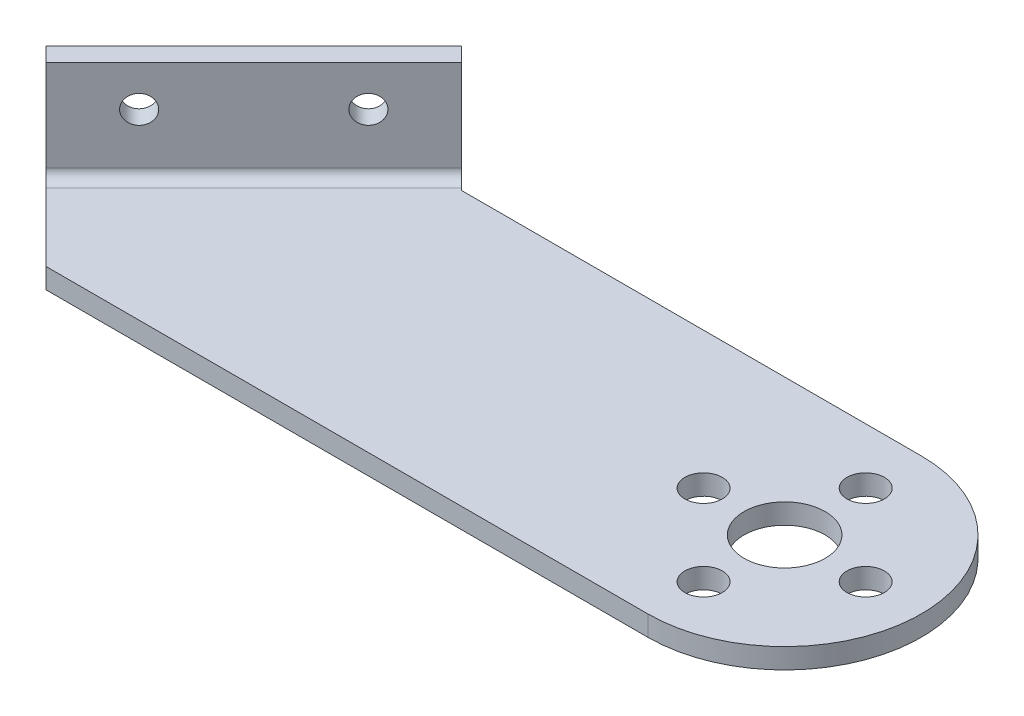
ISO-10303-21;
HEADER;
FILE_DESCRIPTION(('STEP AP214'),'2;1');
FILE_NAME('part.step','',(''),(''),'','','');
FILE_SCHEMA(('AUTOMOTIVE_DESIGN { 1 0 10303 214 1 1 1 1 }'));
ENDSEC;
DATA;
#1=APPLICATION_CONTEXT('core data for automotive mechanical design processes');
#2=APPLICATION_PROTOCOL_DEFINITION('international standard','automotive_design',2000,#1);
#3=PRODUCT_CONTEXT('',#1,'mechanical');
#4=PRODUCT('Part','Part','',(#3));
#5=PRODUCT_RELATED_PRODUCT_CATEGORY('part','',(#4));
#6=PRODUCT_DEFINITION_FORMATION('','',#4);
#7=PRODUCT_DEFINITION_CONTEXT('part definition',#1,'design');
#8=PRODUCT_DEFINITION('design','',#6,#7);
#9=PRODUCT_DEFINITION_SHAPE('','',#8);
#10=(LENGTH_UNIT() NAMED_UNIT(*) SI_UNIT(.MILLI.,.METRE.));
#11=(NAMED_UNIT(*) PLANE_ANGLE_UNIT() SI_UNIT($,.RADIAN.));
#12=(NAMED_UNIT(*) SI_UNIT($,.STERADIAN.) SOLID_ANGLE_UNIT());
#13=UNCERTAINTY_MEASURE_WITH_UNIT(LENGTH_MEASURE(1.E-05),#10,'distance_accuracy_value','');
#14=(GEOMETRIC_REPRESENTATION_CONTEXT(3) GLOBAL_UNCERTAINTY_ASSIGNED_CONTEXT((#13)) GLOBAL_UNIT_ASSIGNED_CONTEXT((#10,
#11,#12)) REPRESENTATION_CONTEXT('',''));
#15=CARTESIAN_POINT('',(0.,0.,0.));
#16=DIRECTION('',(0.,0.,1.));
#17=DIRECTION('',(1.,0.,0.));
#18=AXIS2_PLACEMENT_3D('',#15,#16,#17);
#19=CARTESIAN_POINT('',(13.7940246351911,8.,-9.12741699796952));
#20=DIRECTION('',(-0.707106781186548,0.,-0.707106781186547));
#21=DIRECTION('',(-0.707106781186548,0.,0.707106781186548));
#22=AXIS2_PLACEMENT_3D('',#19,#20,#21);
#23=CYLINDRICAL_SURFACE('',#22,1.36525);
#24=CARTESIAN_POINT('',(11.6727042916315,8.,-11.2487373415292));
#25=DIRECTION('',(-0.707106781186548,0.,-0.707106781186547));
#26=DIRECTION('',(-0.707106781186548,0.,0.707106781186548));
#27=AXIS2_PLACEMENT_3D('',#24,#25,#26);
#28=CIRCLE('',#27,1.36525);
#29=CARTESIAN_POINT('',(10.7073267586166,8.,-10.2833598085142));
#30=VERTEX_POINT('',#29);
#31=EDGE_CURVE('E164',#30,#30,#28,.T.);
#32=ORIENTED_EDGE('',*,*,#31,.T.);
#33=EDGE_LOOP('',(#32));
#34=FACE_BOUND('',#33,.T.);
#35=CARTESIAN_POINT('',(13.0869178540046,8.,-9.83452377915606));
#36=DIRECTION('',(-0.707106781186548,0.,-0.707106781186548));
#37=DIRECTION('',(-0.707106781186548,0.,0.707106781186548));
#38=AXIS2_PLACEMENT_3D('',#35,#36,#37);
#39=CIRCLE('',#38,1.36525);
#40=CARTESIAN_POINT('',(12.1215403209897,8.,-8.86914624614113));
#41=VERTEX_POINT('',#40);
#42=EDGE_CURVE('E206',#41,#41,#39,.T.);
#43=ORIENTED_EDGE('',*,*,#42,.F.);
#44=EDGE_LOOP('',(#43));
#45=FACE_BOUND('',#44,.T.);
#46=ADVANCED_FACE('F49',(#34,#45),#23,.F.);
#47=CARTESIAN_POINT('',(2.48031613620638,8.00000000000001,2.18629150101524));
#48=DIRECTION('',(-0.707106781186548,0.,-0.707106781186547));
#49=DIRECTION('',(-0.707106781186548,0.,0.707106781186548));
#50=AXIS2_PLACEMENT_3D('',#47,#48,#49);
#51=CYLINDRICAL_SURFACE('',#50,1.36525);
#52=CARTESIAN_POINT('',(0.358995792646737,8.00000000000001,0.0649711574556011));
#53=DIRECTION('',(-0.707106781186548,0.,-0.707106781186547));
#54=DIRECTION('',(-0.707106781186548,0.,0.707106781186548));
#55=AXIS2_PLACEMENT_3D('',#52,#53,#54);
#56=CIRCLE('',#55,1.36525);
#57=CARTESIAN_POINT('',(-0.606381740368197,8.00000000000001,1.03034869047054));
#58=VERTEX_POINT('',#57);
#59=EDGE_CURVE('E225',#58,#58,#56,.T.);
#60=ORIENTED_EDGE('',*,*,#59,.T.);
#61=EDGE_LOOP('',(#60));
#62=FACE_BOUND('',#61,.T.);
#63=CARTESIAN_POINT('',(1.77320935501983,8.00000000000001,1.4791847198287));
#64=DIRECTION('',(-0.707106781186548,0.,-0.707106781186548));
#65=DIRECTION('',(-0.707106781186548,0.,0.707106781186548));
#66=AXIS2_PLACEMENT_3D('',#63,#64,#65);
#67=CIRCLE('',#66,1.36525);
#68=CARTESIAN_POINT('',(0.8078318220049,8.00000000000001,2.44456225284363));
#69=VERTEX_POINT('',#68);
#70=EDGE_CURVE('E211',#69,#69,#67,.T.);
#71=ORIENTED_EDGE('',*,*,#70,.F.);
#72=EDGE_LOOP('',(#71));
#73=FACE_BOUND('',#72,.T.);
#74=ADVANCED_FACE('F244',(#62,#73),#51,.F.);
#75=CARTESIAN_POINT('',(70.0090137395217,12.,37.8951839509359));
#76=DIRECTION('',(0.,1.,0.));
#77=DIRECTION('',(-0.707106781186548,0.,0.707106781186548));
#78=AXIS2_PLACEMENT_3D('',#75,#76,#77);
#79=PLANE('',#78);
#80=DIRECTION('',(-0.707106781186548,0.,-0.707106781186548));
#81=VECTOR('',#80,1.);
#82=CARTESIAN_POINT('',(70.0090137395217,12.,37.8951839509359));
#83=LINE('',#82,#81);
#84=CARTESIAN_POINT('',(17.6831119317172,12.,-14.4307178568686));
#85=VERTEX_POINT('',#84);
#86=CARTESIAN_POINT('',(16.2688983693441,12.,-15.8449314192417));
#87=VERTEX_POINT('',#86);
#88=EDGE_CURVE('E223',#85,#87,#83,.T.);
#89=ORIENTED_EDGE('',*,*,#88,.T.);
#90=DIRECTION('',(-0.707106781186547,0.,0.707106781186547));
#91=VECTOR('',#90,1.);
#92=CARTESIAN_POINT('',(16.2688983693441,12.,-15.8449314192417));
#93=LINE('',#92,#91);
#94=CARTESIAN_POINT('',(-4.23719828506582,12.,4.66116523516816));
#95=VERTEX_POINT('',#94);
#96=EDGE_CURVE('E145',#87,#95,#93,.T.);
#97=ORIENTED_EDGE('',*,*,#96,.T.);
#98=DIRECTION('',(-0.707106781186548,0.,-0.707106781186548));
#99=VECTOR('',#98,1.);
#100=CARTESIAN_POINT('',(49.5029170851118,12.,58.4012806053458));
#101=LINE('',#100,#99);
#102=CARTESIAN_POINT('',(-2.82298472269272,12.,6.07537879754126));
#103=VERTEX_POINT('',#102);
#104=EDGE_CURVE('E214',#103,#95,#101,.T.);
#105=ORIENTED_EDGE('',*,*,#104,.F.);
#106=DIRECTION('',(0.707106781186547,0.,-0.707106781186547));
#107=VECTOR('',#106,1.);
#108=CARTESIAN_POINT('',(17.6831119317172,12.,-14.4307178568686));
#109=LINE('',#108,#107);
#110=EDGE_CURVE('E68',#103,#85,#109,.T.);
#111=ORIENTED_EDGE('',*,*,#110,.T.);
#112=EDGE_LOOP('',(#89,#97,#105,#111));
#113=FACE_BOUND('',#112,.T.);
#114=ADVANCED_FACE('F241',(#113),#79,.T.);
#115=CARTESIAN_POINT('',(70.0090137395217,12.,37.8951839509359));
#116=DIRECTION('',(0.707106781186548,0.,-0.707106781186548));
#117=DIRECTION('',(0.,1.,0.));
#118=AXIS2_PLACEMENT_3D('',#115,#116,#117);
#119=PLANE('',#118);
#120=DIRECTION('',(-0.707106781186548,0.,-0.707106781186548));
#121=VECTOR('',#120,1.);
#122=CARTESIAN_POINT('',(70.0090137395217,3.,37.8951839509359));
#123=LINE('',#122,#121);
#124=CARTESIAN_POINT('',(17.6831119317172,3.,-14.4307178568686));
#125=VERTEX_POINT('',#124);
#126=CARTESIAN_POINT('',(16.2688983693441,3.,-15.8449314192417));
#127=VERTEX_POINT('',#126);
#128=EDGE_CURVE('E147',#125,#127,#123,.T.);
#129=ORIENTED_EDGE('',*,*,#128,.T.);
#130=DIRECTION('',(0.,1.,0.));
#131=VECTOR('',#130,1.);
#132=CARTESIAN_POINT('',(16.2688983693441,0.,-15.8449314192417));
#133=LINE('',#132,#131);
#134=EDGE_CURVE('E93',#127,#87,#133,.T.);
#135=ORIENTED_EDGE('',*,*,#134,.T.);
#136=ORIENTED_EDGE('',*,*,#88,.F.);
#137=DIRECTION('',(0.,-1.,0.));
#138=VECTOR('',#137,1.);
#139=CARTESIAN_POINT('',(17.6831119317172,12.,-14.4307178568686));
#140=LINE('',#139,#138);
#141=EDGE_CURVE('E146',#85,#125,#140,.T.);
#142=ORIENTED_EDGE('',*,*,#141,.T.);
#143=EDGE_LOOP('',(#129,#135,#136,#142));
#144=FACE_BOUND('',#143,.T.);
#145=ADVANCED_FACE('F151',(#144),#119,.T.);
#146=CARTESIAN_POINT('',(16.2688983693441,0.,-15.8449314192417));
#147=DIRECTION('',(-0.707106781186547,0.,-0.707106781186548));
#148=DIRECTION('',(-0.707106781186548,0.,0.707106781186548));
#149=AXIS2_PLACEMENT_3D('',#146,#147,#148);
#150=PLANE('',#149);
#151=DIRECTION('',(0.707106781186548,0.,-0.707106781186547));
#152=VECTOR('',#151,1.);
#153=CARTESIAN_POINT('',(16.2688983693441,3.00000000000001,-15.8449314192417));
#154=LINE('',#153,#152);
#155=CARTESIAN_POINT('',(-4.23719828506582,3.,4.66116523516816));
#156=VERTEX_POINT('',#155);
#157=EDGE_CURVE('E87',#156,#127,#154,.T.);
#158=ORIENTED_EDGE('',*,*,#157,.F.);
#159=DIRECTION('',(0.,1.,0.));
#160=VECTOR('',#159,1.);
#161=CARTESIAN_POINT('',(-4.23719828506582,12.,4.66116523516816));
#162=LINE('',#161,#160);
#163=EDGE_CURVE('E216',#156,#95,#162,.T.);
#164=ORIENTED_EDGE('',*,*,#163,.T.);
#165=ORIENTED_EDGE('',*,*,#96,.F.);
#166=ORIENTED_EDGE('',*,*,#134,.F.);
#167=EDGE_LOOP('',(#158,#164,#165,#166));
#168=FACE_BOUND('',#167,.T.);
#169=ORIENTED_EDGE('',*,*,#59,.F.);
#170=EDGE_LOOP('',(#169));
#171=FACE_BOUND('',#170,.T.);
#172=ORIENTED_EDGE('',*,*,#31,.F.);
#173=EDGE_LOOP('',(#172));
#174=FACE_BOUND('',#173,.T.);
#175=ADVANCED_FACE('F142',(#168,#171,#174),#150,.T.);
#176=CARTESIAN_POINT('',(49.5029170851118,12.,58.4012806053458));
#177=DIRECTION('',(0.707106781186548,0.,-0.707106781186548));
#178=DIRECTION('',(0.,1.,0.));
#179=AXIS2_PLACEMENT_3D('',#176,#177,#178);
#180=PLANE('',#179);
#181=ORIENTED_EDGE('',*,*,#163,.F.);
#182=DIRECTION('',(-0.707106781186548,0.,-0.707106781186548));
#183=VECTOR('',#182,1.);
#184=CARTESIAN_POINT('',(49.5029170851118,3.,58.4012806053458));
#185=LINE('',#184,#183);
#186=CARTESIAN_POINT('',(-2.82298472269272,2.99999999999999,6.07537879754126));
#187=VERTEX_POINT('',#186);
#188=EDGE_CURVE('E53',#187,#156,#185,.T.);
#189=ORIENTED_EDGE('',*,*,#188,.F.);
#190=DIRECTION('',(0.,-1.,0.));
#191=VECTOR('',#190,1.);
#192=CARTESIAN_POINT('',(-2.82298472269272,12.,6.07537879754126));
#193=LINE('',#192,#191);
#194=EDGE_CURVE('E59',#103,#187,#193,.T.);
#195=ORIENTED_EDGE('',*,*,#194,.F.);
#196=ORIENTED_EDGE('',*,*,#104,.T.);
#197=EDGE_LOOP('',(#181,#189,#195,#196));
#198=FACE_BOUND('',#197,.T.);
#199=ADVANCED_FACE('F234',(#198),#180,.F.);
#200=CARTESIAN_POINT('',(17.6831119317172,12.,-14.4307178568686));
#201=DIRECTION('',(-0.707106781186548,0.,-0.707106781186548));
#202=DIRECTION('',(-0.707106781186548,0.,0.707106781186548));
#203=AXIS2_PLACEMENT_3D('',#200,#201,#202);
#204=PLANE('',#203);
#205=ORIENTED_EDGE('',*,*,#70,.T.);
#206=EDGE_LOOP('',(#205));
#207=FACE_BOUND('',#206,.T.);
#208=ORIENTED_EDGE('',*,*,#42,.T.);
#209=EDGE_LOOP('',(#208));
#210=FACE_BOUND('',#209,.T.);
#211=ORIENTED_EDGE('',*,*,#194,.T.);
#212=DIRECTION('',(0.707106781186548,0.,-0.707106781186548));
#213=VECTOR('',#212,1.);
#214=CARTESIAN_POINT('',(17.6831119317172,3.,-14.4307178568686));
#215=LINE('',#214,#213);
#216=EDGE_CURVE('E13',#187,#125,#215,.T.);
#217=ORIENTED_EDGE('',*,*,#216,.T.);
#218=ORIENTED_EDGE('',*,*,#141,.F.);
#219=ORIENTED_EDGE('',*,*,#110,.F.);
#220=EDGE_LOOP('',(#211,#217,#218,#219));
#221=FACE_BOUND('',#220,.T.);
#222=ADVANCED_FACE('F51',(#207,#210,#221),#204,.F.);
#223=CARTESIAN_POINT('',(64.,0.,0.));
#224=DIRECTION('',(0.,1.,0.));
#225=DIRECTION('',(0.,0.,1.));
#226=AXIS2_PLACEMENT_3D('',#223,#224,#225);
#227=PLANE('',#226);
#228=CARTESIAN_POINT('',(56.,0.,0.));
#229=DIRECTION('',(0.,1.,0.));
#230=DIRECTION('',(0.,0.,-1.));
#231=AXIS2_PLACEMENT_3D('',#228,#229,#230);
#232=CIRCLE('',#231,1.85);
#233=CARTESIAN_POINT('',(56.,0.,-1.85));
#234=VERTEX_POINT('',#233);
#235=EDGE_CURVE('E289',#234,#234,#232,.T.);
#236=ORIENTED_EDGE('',*,*,#235,.T.);
#237=EDGE_LOOP('',(#236));
#238=FACE_BOUND('',#237,.T.);
#239=CARTESIAN_POINT('',(64.,0.,8.));
#240=DIRECTION('',(0.,1.,0.));
#241=DIRECTION('',(0.,0.,-1.));
#242=AXIS2_PLACEMENT_3D('',#239,#240,#241);
#243=CIRCLE('',#242,1.85);
#244=CARTESIAN_POINT('',(64.,0.,6.15));
#245=VERTEX_POINT('',#244);
#246=EDGE_CURVE('E370',#245,#245,#243,.T.);
#247=ORIENTED_EDGE('',*,*,#246,.T.);
#248=EDGE_LOOP('',(#247));
#249=FACE_BOUND('',#248,.T.);
#250=CARTESIAN_POINT('',(72.,0.,0.));
#251=DIRECTION('',(0.,1.,0.));
#252=DIRECTION('',(0.,0.,-1.));
#253=AXIS2_PLACEMENT_3D('',#250,#251,#252);
#254=CIRCLE('',#253,1.85);
#255=CARTESIAN_POINT('',(72.,0.,-1.85));
#256=VERTEX_POINT('',#255);
#257=EDGE_CURVE('E367',#256,#256,#254,.T.);
#258=ORIENTED_EDGE('',*,*,#257,.T.);
#259=EDGE_LOOP('',(#258));
#260=FACE_BOUND('',#259,.T.);
#261=CARTESIAN_POINT('',(64.,0.,-8.));
#262=DIRECTION('',(0.,1.,0.));
#263=DIRECTION('',(0.,0.,-1.));
#264=AXIS2_PLACEMENT_3D('',#261,#262,#263);
#265=CIRCLE('',#264,1.85);
#266=CARTESIAN_POINT('',(64.,0.,-9.85));
#267=VERTEX_POINT('',#266);
#268=EDGE_CURVE('E358',#267,#267,#265,.T.);
#269=ORIENTED_EDGE('',*,*,#268,.T.);
#270=EDGE_LOOP('',(#269));
#271=FACE_BOUND('',#270,.T.);
#272=CARTESIAN_POINT('',(64.,0.,0.));
#273=DIRECTION('',(0.,1.,0.));
#274=DIRECTION('',(0.,0.,-1.));
#275=AXIS2_PLACEMENT_3D('',#272,#273,#274);
#276=CIRCLE('',#275,4.);
#277=CARTESIAN_POINT('',(64.,0.,-4.));
#278=VERTEX_POINT('',#277);
#279=EDGE_CURVE('E354',#278,#278,#276,.T.);
#280=ORIENTED_EDGE('',*,*,#279,.T.);
#281=EDGE_LOOP('',(#280));
#282=FACE_BOUND('',#281,.T.);
#283=DIRECTION('',(-0.707106781186547,0.,0.707106781186548));
#284=VECTOR('',#283,1.);
#285=CARTESIAN_POINT('',(18.3902187129037,0.,-13.7236110756821));
#286=LINE('',#285,#284);
#287=CARTESIAN_POINT('',(18.3902187129037,0.,-13.7236110756821));
#288=VERTEX_POINT('',#287);
#289=CARTESIAN_POINT('',(-2.11587794150617,0.,6.78248557872781));
#290=VERTEX_POINT('',#289);
#291=EDGE_CURVE('E189',#288,#290,#286,.T.);
#292=ORIENTED_EDGE('',*,*,#291,.F.);
#293=DIRECTION('',(-0.707106781186547,0.,-0.707106781186548));
#294=VECTOR('',#293,1.);
#295=CARTESIAN_POINT('',(18.6138297885858,0.,-13.5));
#296=LINE('',#295,#294);
#297=CARTESIAN_POINT('',(18.6138297885858,0.,-13.5));
#298=VERTEX_POINT('',#297);
#299=EDGE_CURVE('E281',#298,#288,#296,.T.);
#300=ORIENTED_EDGE('',*,*,#299,.F.);
#301=DIRECTION('',(-1.,0.,0.));
#302=VECTOR('',#301,1.);
#303=CARTESIAN_POINT('',(64.,0.,-13.5));
#304=LINE('',#303,#302);
#305=CARTESIAN_POINT('',(64.,0.,-13.5));
#306=VERTEX_POINT('',#305);
#307=EDGE_CURVE('E284',#306,#298,#304,.T.);
#308=ORIENTED_EDGE('',*,*,#307,.F.);
#309=CARTESIAN_POINT('',(64.,0.,0.));
#310=DIRECTION('',(0.,1.,0.));
#311=DIRECTION('',(0.,0.,1.));
#312=AXIS2_PLACEMENT_3D('',#309,#310,#311);
#313=CIRCLE('',#312,13.5);
#314=CARTESIAN_POINT('',(64.,0.,13.5));
#315=VERTEX_POINT('',#314);
#316=EDGE_CURVE('E287',#315,#306,#313,.T.);
#317=ORIENTED_EDGE('',*,*,#316,.F.);
#318=DIRECTION('',(1.,0.,0.));
#319=VECTOR('',#318,1.);
#320=CARTESIAN_POINT('',(4.60163647976604,0.,13.5));
#321=LINE('',#320,#319);
#322=CARTESIAN_POINT('',(4.60163647976604,0.,13.5));
#323=VERTEX_POINT('',#322);
#324=EDGE_CURVE('E184',#323,#315,#321,.T.);
#325=ORIENTED_EDGE('',*,*,#324,.F.);
#326=DIRECTION('',(0.707106781186548,0.,0.707106781186547));
#327=VECTOR('',#326,1.);
#328=CARTESIAN_POINT('',(-4.23719828506582,0.,4.66116523516815));
#329=LINE('',#328,#327);
#330=EDGE_CURVE('E285',#290,#323,#329,.T.);
#331=ORIENTED_EDGE('',*,*,#330,.F.);
#332=EDGE_LOOP('',(#292,#300,#308,#317,#325,#331));
#333=FACE_BOUND('',#332,.T.);
#334=ADVANCED_FACE('F330',(#238,#249,#260,#271,#282,#333),#227,.F.);
#335=CARTESIAN_POINT('',(64.,2.,0.));
#336=DIRECTION('',(0.,1.,0.));
#337=DIRECTION('',(0.,0.,1.));
#338=AXIS2_PLACEMENT_3D('',#335,#336,#337);
#339=PLANE('',#338);
#340=CARTESIAN_POINT('',(64.,2.,0.));
#341=DIRECTION('',(0.,1.,0.));
#342=DIRECTION('',(0.,0.,-1.));
#343=AXIS2_PLACEMENT_3D('',#340,#341,#342);
#344=CIRCLE('',#343,4.);
#345=CARTESIAN_POINT('',(64.,2.,-4.));
#346=VERTEX_POINT('',#345);
#347=EDGE_CURVE('E384',#346,#346,#344,.T.);
#348=ORIENTED_EDGE('',*,*,#347,.F.);
#349=EDGE_LOOP('',(#348));
#350=FACE_BOUND('',#349,.T.);
#351=CARTESIAN_POINT('',(64.,2.,-8.));
#352=DIRECTION('',(0.,1.,0.));
#353=DIRECTION('',(0.,0.,-1.));
#354=AXIS2_PLACEMENT_3D('',#351,#352,#353);
#355=CIRCLE('',#354,1.85);
#356=CARTESIAN_POINT('',(64.,2.,-9.85));
#357=VERTEX_POINT('',#356);
#358=EDGE_CURVE('E382',#357,#357,#355,.T.);
#359=ORIENTED_EDGE('',*,*,#358,.F.);
#360=EDGE_LOOP('',(#359));
#361=FACE_BOUND('',#360,.T.);
#362=CARTESIAN_POINT('',(72.,2.,0.));
#363=DIRECTION('',(0.,1.,0.));
#364=DIRECTION('',(0.,0.,-1.));
#365=AXIS2_PLACEMENT_3D('',#362,#363,#364);
#366=CIRCLE('',#365,1.85);
#367=CARTESIAN_POINT('',(72.,2.,-1.85));
#368=VERTEX_POINT('',#367);
#369=EDGE_CURVE('E361',#368,#368,#366,.T.);
#370=ORIENTED_EDGE('',*,*,#369,.F.);
#371=EDGE_LOOP('',(#370));
#372=FACE_BOUND('',#371,.T.);
#373=CARTESIAN_POINT('',(64.,2.,8.));
#374=DIRECTION('',(0.,1.,0.));
#375=DIRECTION('',(0.,0.,-1.));
#376=AXIS2_PLACEMENT_3D('',#373,#374,#375);
#377=CIRCLE('',#376,1.85);
#378=CARTESIAN_POINT('',(64.,2.,6.15));
#379=VERTEX_POINT('',#378);
#380=EDGE_CURVE('E355',#379,#379,#377,.T.);
#381=ORIENTED_EDGE('',*,*,#380,.F.);
#382=EDGE_LOOP('',(#381));
#383=FACE_BOUND('',#382,.T.);
#384=CARTESIAN_POINT('',(56.,2.,0.));
#385=DIRECTION('',(0.,1.,0.));
#386=DIRECTION('',(0.,0.,-1.));
#387=AXIS2_PLACEMENT_3D('',#384,#385,#386);
#388=CIRCLE('',#387,1.85);
#389=CARTESIAN_POINT('',(56.,2.,-1.85));
#390=VERTEX_POINT('',#389);
#391=EDGE_CURVE('E352',#390,#390,#388,.T.);
#392=ORIENTED_EDGE('',*,*,#391,.F.);
#393=EDGE_LOOP('',(#392));
#394=FACE_BOUND('',#393,.T.);
#395=DIRECTION('',(-0.707106781186547,0.,-0.707106781186548));
#396=VECTOR('',#395,1.);
#397=CARTESIAN_POINT('',(18.6138297885858,2.,-13.5));
#398=LINE('',#397,#396);
#399=CARTESIAN_POINT('',(18.6138297885858,2.,-13.5));
#400=VERTEX_POINT('',#399);
#401=CARTESIAN_POINT('',(18.3902187129037,2.,-13.7236110756821));
#402=VERTEX_POINT('',#401);
#403=EDGE_CURVE('E278',#400,#402,#398,.T.);
#404=ORIENTED_EDGE('',*,*,#403,.T.);
#405=DIRECTION('',(-0.707106781186547,0.,0.707106781186548));
#406=VECTOR('',#405,1.);
#407=CARTESIAN_POINT('',(18.3902187129037,2.,-13.7236110756821));
#408=LINE('',#407,#406);
#409=CARTESIAN_POINT('',(-2.11587794150617,2.,6.7824855787278));
#410=VERTEX_POINT('',#409);
#411=EDGE_CURVE('E186',#402,#410,#408,.T.);
#412=ORIENTED_EDGE('',*,*,#411,.T.);
#413=DIRECTION('',(0.707106781186548,0.,0.707106781186547));
#414=VECTOR('',#413,1.);
#415=CARTESIAN_POINT('',(-4.23719828506582,2.,4.66116523516815));
#416=LINE('',#415,#414);
#417=CARTESIAN_POINT('',(4.60163647976604,2.00000000000006,13.5));
#418=VERTEX_POINT('',#417);
#419=EDGE_CURVE('E170',#410,#418,#416,.T.);
#420=ORIENTED_EDGE('',*,*,#419,.T.);
#421=DIRECTION('',(1.,0.,0.));
#422=VECTOR('',#421,1.);
#423=CARTESIAN_POINT('',(4.60163647976604,2.,13.5));
#424=LINE('',#423,#422);
#425=CARTESIAN_POINT('',(64.,2.00000000000006,13.5));
#426=VERTEX_POINT('',#425);
#427=EDGE_CURVE('E101',#418,#426,#424,.T.);
#428=ORIENTED_EDGE('',*,*,#427,.T.);
#429=CARTESIAN_POINT('',(64.,2.,0.));
#430=DIRECTION('',(0.,1.,0.));
#431=DIRECTION('',(0.,0.,1.));
#432=AXIS2_PLACEMENT_3D('',#429,#430,#431);
#433=CIRCLE('',#432,13.5);
#434=CARTESIAN_POINT('',(64.,2.00000000000006,-13.5));
#435=VERTEX_POINT('',#434);
#436=EDGE_CURVE('E109',#426,#435,#433,.T.);
#437=ORIENTED_EDGE('',*,*,#436,.T.);
#438=DIRECTION('',(-1.,0.,0.));
#439=VECTOR('',#438,1.);
#440=CARTESIAN_POINT('',(64.,2.,-13.5));
#441=LINE('',#440,#439);
#442=EDGE_CURVE('E393',#435,#400,#441,.T.);
#443=ORIENTED_EDGE('',*,*,#442,.T.);
#444=EDGE_LOOP('',(#404,#412,#420,#428,#437,#443));
#445=FACE_BOUND('',#444,.T.);
#446=ADVANCED_FACE('F275',(#350,#361,#372,#383,#394,#445),#339,.T.);
#447=CARTESIAN_POINT('',(56.,0.,0.));
#448=DIRECTION('',(0.,1.,0.));
#449=DIRECTION('',(0.,0.,1.));
#450=AXIS2_PLACEMENT_3D('',#447,#448,#449);
#451=CYLINDRICAL_SURFACE('',#450,1.85);
#452=ORIENTED_EDGE('',*,*,#235,.F.);
#453=EDGE_LOOP('',(#452));
#454=FACE_BOUND('',#453,.T.);
#455=ORIENTED_EDGE('',*,*,#391,.T.);
#456=EDGE_LOOP('',(#455));
#457=FACE_BOUND('',#456,.T.);
#458=ADVANCED_FACE('F339',(#454,#457),#451,.F.);
#459=CARTESIAN_POINT('',(64.,0.,8.));
#460=DIRECTION('',(0.,1.,0.));
#461=DIRECTION('',(0.,0.,1.));
#462=AXIS2_PLACEMENT_3D('',#459,#460,#461);
#463=CYLINDRICAL_SURFACE('',#462,1.85);
#464=ORIENTED_EDGE('',*,*,#246,.F.);
#465=EDGE_LOOP('',(#464));
#466=FACE_BOUND('',#465,.T.);
#467=ORIENTED_EDGE('',*,*,#380,.T.);
#468=EDGE_LOOP('',(#467));
#469=FACE_BOUND('',#468,.T.);
#470=ADVANCED_FACE('F336',(#466,#469),#463,.F.);
#471=CARTESIAN_POINT('',(72.,0.,0.));
#472=DIRECTION('',(0.,1.,0.));
#473=DIRECTION('',(0.,0.,1.));
#474=AXIS2_PLACEMENT_3D('',#471,#472,#473);
#475=CYLINDRICAL_SURFACE('',#474,1.85);
#476=ORIENTED_EDGE('',*,*,#257,.F.);
#477=EDGE_LOOP('',(#476));
#478=FACE_BOUND('',#477,.T.);
#479=ORIENTED_EDGE('',*,*,#369,.T.);
#480=EDGE_LOOP('',(#479));
#481=FACE_BOUND('',#480,.T.);
#482=ADVANCED_FACE('F322',(#478,#481),#475,.F.);
#483=CARTESIAN_POINT('',(64.,0.,-8.));
#484=DIRECTION('',(0.,1.,0.));
#485=DIRECTION('',(0.,0.,1.));
#486=AXIS2_PLACEMENT_3D('',#483,#484,#485);
#487=CYLINDRICAL_SURFACE('',#486,1.85);
#488=ORIENTED_EDGE('',*,*,#268,.F.);
#489=EDGE_LOOP('',(#488));
#490=FACE_BOUND('',#489,.T.);
#491=ORIENTED_EDGE('',*,*,#358,.T.);
#492=EDGE_LOOP('',(#491));
#493=FACE_BOUND('',#492,.T.);
#494=ADVANCED_FACE('F316',(#490,#493),#487,.F.);
#495=CARTESIAN_POINT('',(64.,0.,0.));
#496=DIRECTION('',(0.,1.,0.));
#497=DIRECTION('',(0.,0.,1.));
#498=AXIS2_PLACEMENT_3D('',#495,#496,#497);
#499=CYLINDRICAL_SURFACE('',#498,4.);
#500=ORIENTED_EDGE('',*,*,#279,.F.);
#501=EDGE_LOOP('',(#500));
#502=FACE_BOUND('',#501,.T.);
#503=ORIENTED_EDGE('',*,*,#347,.T.);
#504=EDGE_LOOP('',(#503));
#505=FACE_BOUND('',#504,.T.);
#506=ADVANCED_FACE('F312',(#502,#505),#499,.F.);
#507=CARTESIAN_POINT('',(18.6138297885858,168.283249557367,-13.5));
#508=DIRECTION('',(-0.707106781186548,0.,0.707106781186547));
#509=DIRECTION('',(0.707106781186547,0.,0.707106781186548));
#510=AXIS2_PLACEMENT_3D('',#507,#508,#509);
#511=PLANE('',#510);
#512=DIRECTION('',(0.,-1.,0.));
#513=VECTOR('',#512,1.);
#514=CARTESIAN_POINT('',(18.6138297885858,168.283249557367,-13.5));
#515=LINE('',#514,#513);
#516=EDGE_CURVE('E191',#400,#298,#515,.T.);
#517=ORIENTED_EDGE('',*,*,#516,.T.);
#518=ORIENTED_EDGE('',*,*,#299,.T.);
#519=DIRECTION('',(0.,-1.,0.));
#520=VECTOR('',#519,1.);
#521=CARTESIAN_POINT('',(18.3902187129037,168.283249557367,-13.7236110756821));
#522=LINE('',#521,#520);
#523=EDGE_CURVE('E167',#402,#288,#522,.T.);
#524=ORIENTED_EDGE('',*,*,#523,.F.);
#525=ORIENTED_EDGE('',*,*,#403,.F.);
#526=EDGE_LOOP('',(#517,#518,#524,#525));
#527=FACE_BOUND('',#526,.T.);
#528=ADVANCED_FACE('F252',(#527),#511,.F.);
#529=CARTESIAN_POINT('',(-4.23719828506582,168.283249557367,4.66116523516815));
#530=DIRECTION('',(0.707106781186547,0.,-0.707106781186548));
#531=DIRECTION('',(-0.707106781186548,0.,-0.707106781186547));
#532=AXIS2_PLACEMENT_3D('',#529,#530,#531);
#533=PLANE('',#532);
#534=DIRECTION('',(0.,-1.,0.));
#535=VECTOR('',#534,1.);
#536=CARTESIAN_POINT('',(-2.11587794150617,168.283249557367,6.7824855787278));
#537=LINE('',#536,#535);
#538=EDGE_CURVE('E201',#410,#290,#537,.T.);
#539=ORIENTED_EDGE('',*,*,#538,.T.);
#540=ORIENTED_EDGE('',*,*,#330,.T.);
#541=DIRECTION('',(0.,-1.,0.));
#542=VECTOR('',#541,1.);
#543=CARTESIAN_POINT('',(4.60163647976604,168.283249557367,13.5));
#544=LINE('',#543,#542);
#545=EDGE_CURVE('E199',#418,#323,#544,.T.);
#546=ORIENTED_EDGE('',*,*,#545,.F.);
#547=ORIENTED_EDGE('',*,*,#419,.F.);
#548=EDGE_LOOP('',(#539,#540,#546,#547));
#549=FACE_BOUND('',#548,.T.);
#550=ADVANCED_FACE('F272',(#549),#533,.F.);
#551=CARTESIAN_POINT('',(4.60163647976604,168.283249557367,13.5));
#552=DIRECTION('',(0.,0.,-1.));
#553=DIRECTION('',(-1.,0.,0.));
#554=AXIS2_PLACEMENT_3D('',#551,#552,#553);
#555=PLANE('',#554);
#556=ORIENTED_EDGE('',*,*,#545,.T.);
#557=ORIENTED_EDGE('',*,*,#324,.T.);
#558=DIRECTION('',(0.,-1.,0.));
#559=VECTOR('',#558,1.);
#560=CARTESIAN_POINT('',(64.,168.283249557367,13.5));
#561=LINE('',#560,#559);
#562=EDGE_CURVE('E197',#426,#315,#561,.T.);
#563=ORIENTED_EDGE('',*,*,#562,.F.);
#564=ORIENTED_EDGE('',*,*,#427,.F.);
#565=EDGE_LOOP('',(#556,#557,#563,#564));
#566=FACE_BOUND('',#565,.T.);
#567=ADVANCED_FACE('F294',(#566),#555,.F.);
#568=CARTESIAN_POINT('',(64.,168.283249557367,0.));
#569=DIRECTION('',(0.,-1.,0.));
#570=DIRECTION('',(0.,0.,-1.));
#571=AXIS2_PLACEMENT_3D('',#568,#569,#570);
#572=CYLINDRICAL_SURFACE('',#571,13.5);
#573=ORIENTED_EDGE('',*,*,#562,.T.);
#574=ORIENTED_EDGE('',*,*,#316,.T.);
#575=DIRECTION('',(0.,-1.,0.));
#576=VECTOR('',#575,1.);
#577=CARTESIAN_POINT('',(64.,168.283249557367,-13.5));
#578=LINE('',#577,#576);
#579=EDGE_CURVE('E194',#435,#306,#578,.T.);
#580=ORIENTED_EDGE('',*,*,#579,.F.);
#581=ORIENTED_EDGE('',*,*,#436,.F.);
#582=EDGE_LOOP('',(#573,#574,#580,#581));
#583=FACE_BOUND('',#582,.T.);
#584=ADVANCED_FACE('F296',(#583),#572,.T.);
#585=CARTESIAN_POINT('',(64.,168.283249557367,-13.5));
#586=DIRECTION('',(0.,0.,1.));
#587=DIRECTION('',(1.,0.,0.));
#588=AXIS2_PLACEMENT_3D('',#585,#586,#587);
#589=PLANE('',#588);
#590=ORIENTED_EDGE('',*,*,#579,.T.);
#591=ORIENTED_EDGE('',*,*,#307,.T.);
#592=ORIENTED_EDGE('',*,*,#516,.F.);
#593=ORIENTED_EDGE('',*,*,#442,.F.);
#594=EDGE_LOOP('',(#590,#591,#592,#593));
#595=FACE_BOUND('',#594,.T.);
#596=ADVANCED_FACE('F298',(#595),#589,.F.);
#597=CARTESIAN_POINT('',(-2.11587794150618,3.,6.78248557872782));
#598=DIRECTION('',(-0.707106781186547,0.,0.707106781186549));
#599=DIRECTION('',(0.707106781186549,0.,0.707106781186547));
#600=AXIS2_PLACEMENT_3D('',#597,#598,#599);
#601=PLANE('',#600);
#602=ORIENTED_EDGE('',*,*,#538,.F.);
#603=CARTESIAN_POINT('',(-2.11587794150617,3.,6.78248557872781));
#604=DIRECTION('',(-0.707106781186547,0.,0.707106781186547));
#605=DIRECTION('',(0.707106781186548,0.,0.707106781186548));
#606=AXIS2_PLACEMENT_3D('',#603,#604,#605);
#607=CIRCLE('',#606,1.);
#608=EDGE_CURVE('E168',#410,#187,#607,.F.);
#609=ORIENTED_EDGE('',*,*,#608,.T.);
#610=ORIENTED_EDGE('',*,*,#188,.T.);
#611=CARTESIAN_POINT('',(-2.11587794150617,3.,6.78248557872781));
#612=DIRECTION('',(-0.707106781186547,0.,0.707106781186547));
#613=DIRECTION('',(0.707106781186548,0.,0.707106781186548));
#614=AXIS2_PLACEMENT_3D('',#611,#612,#613);
#615=CIRCLE('',#614,3.);
#616=EDGE_CURVE('E163',#290,#156,#615,.F.);
#617=ORIENTED_EDGE('',*,*,#616,.F.);
#618=EDGE_LOOP('',(#602,#609,#610,#617));
#619=FACE_BOUND('',#618,.T.);
#620=ADVANCED_FACE('F268',(#619),#601,.T.);
#621=CARTESIAN_POINT('',(18.3902187129037,3.,-13.7236110756821));
#622=DIRECTION('',(0.707106781186549,0.,-0.707106781186547));
#623=DIRECTION('',(-0.707106781186547,0.,-0.707106781186549));
#624=AXIS2_PLACEMENT_3D('',#621,#622,#623);
#625=PLANE('',#624);
#626=ORIENTED_EDGE('',*,*,#128,.F.);
#627=CARTESIAN_POINT('',(18.3902187129037,3.,-13.7236110756821));
#628=DIRECTION('',(-0.707106781186547,0.,0.707106781186547));
#629=DIRECTION('',(0.707106781186548,0.,0.707106781186548));
#630=AXIS2_PLACEMENT_3D('',#627,#628,#629);
#631=CIRCLE('',#630,1.);
#632=EDGE_CURVE('E173',#125,#402,#631,.T.);
#633=ORIENTED_EDGE('',*,*,#632,.T.);
#634=ORIENTED_EDGE('',*,*,#523,.T.);
#635=CARTESIAN_POINT('',(18.3902187129037,3.,-13.7236110756821));
#636=DIRECTION('',(-0.707106781186547,0.,0.707106781186547));
#637=DIRECTION('',(0.707106781186548,0.,0.707106781186548));
#638=AXIS2_PLACEMENT_3D('',#635,#636,#637);
#639=CIRCLE('',#638,3.);
#640=EDGE_CURVE('E161',#127,#288,#639,.T.);
#641=ORIENTED_EDGE('',*,*,#640,.F.);
#642=EDGE_LOOP('',(#626,#633,#634,#641));
#643=FACE_BOUND('',#642,.T.);
#644=ADVANCED_FACE('F165',(#643),#625,.T.);
#645=CARTESIAN_POINT('',(85.4305420946151,3.,-80.7639344573934));
#646=DIRECTION('',(-0.707106781186547,0.,0.707106781186547));
#647=DIRECTION('',(0.707106781186548,0.,0.707106781186548));
#648=AXIS2_PLACEMENT_3D('',#645,#646,#647);
#649=CYLINDRICAL_SURFACE('',#648,3.);
#650=ORIENTED_EDGE('',*,*,#640,.T.);
#651=ORIENTED_EDGE('',*,*,#291,.T.);
#652=ORIENTED_EDGE('',*,*,#616,.T.);
#653=ORIENTED_EDGE('',*,*,#157,.T.);
#654=EDGE_LOOP('',(#650,#651,#652,#653));
#655=FACE_BOUND('',#654,.T.);
#656=ADVANCED_FACE('F159',(#655),#649,.T.);
#657=CARTESIAN_POINT('',(85.4305420946151,3.,-80.7639344573934));
#658=DIRECTION('',(-0.707106781186547,0.,0.707106781186547));
#659=DIRECTION('',(0.707106781186548,0.,0.707106781186548));
#660=AXIS2_PLACEMENT_3D('',#657,#658,#659);
#661=CYLINDRICAL_SURFACE('',#660,1.);
#662=ORIENTED_EDGE('',*,*,#632,.F.);
#663=ORIENTED_EDGE('',*,*,#216,.F.);
#664=ORIENTED_EDGE('',*,*,#608,.F.);
#665=ORIENTED_EDGE('',*,*,#411,.F.);
#666=EDGE_LOOP('',(#662,#663,#664,#665));
#667=FACE_BOUND('',#666,.T.);
#668=ADVANCED_FACE('F264',(#667),#661,.F.);
#669=CLOSED_SHELL('',(#46,#74,#114,#145,#175,#199,#222,#334,#446,#458,#470,#482,#494,#506,#528,
#550,#567,#584,#596,#620,#644,#656,#668));
#670=MANIFOLD_SOLID_BREP('B2',#669);
#671=ADVANCED_BREP_SHAPE_REPRESENTATION('',(#18,#670),#14);
#672=SHAPE_DEFINITION_REPRESENTATION(#9,#671);
ENDSEC;
END-ISO-10303-21;
